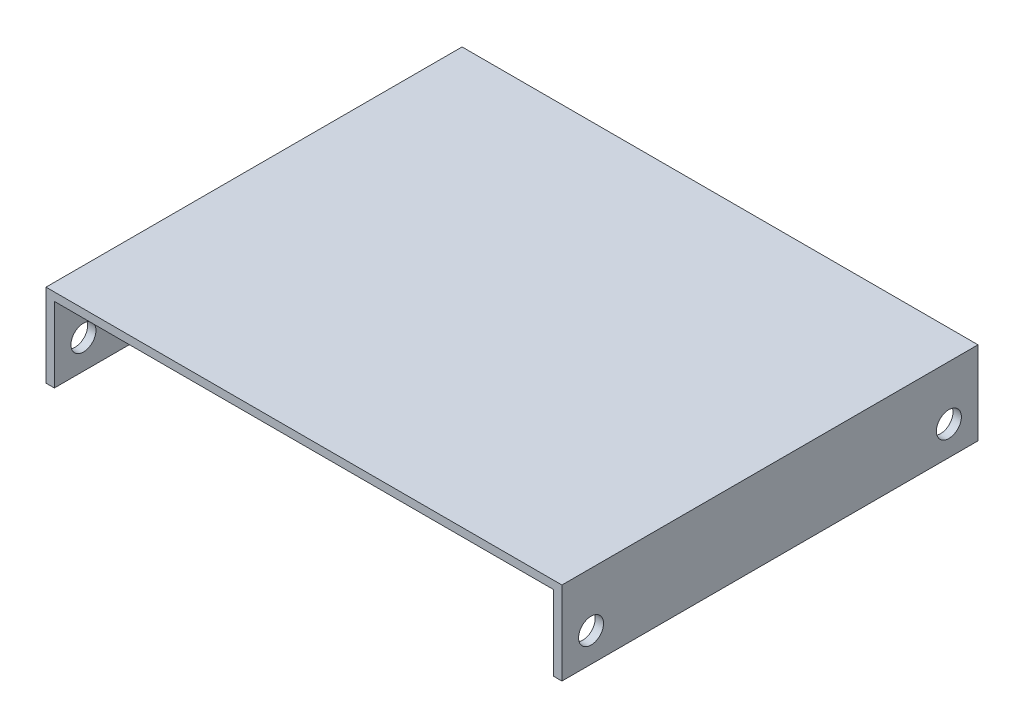
ISO-10303-21;
HEADER;
FILE_DESCRIPTION(('STEP AP214'),'2;1');
FILE_NAME('part.step','',(''),(''),'','','');
FILE_SCHEMA(('AUTOMOTIVE_DESIGN { 1 0 10303 214 1 1 1 1 }'));
ENDSEC;
DATA;
#1=APPLICATION_CONTEXT('core data for automotive mechanical design processes');
#2=APPLICATION_PROTOCOL_DEFINITION('international standard','automotive_design',2000,#1);
#3=PRODUCT_CONTEXT('',#1,'mechanical');
#4=PRODUCT('Part','Part','',(#3));
#5=PRODUCT_RELATED_PRODUCT_CATEGORY('part','',(#4));
#6=PRODUCT_DEFINITION_FORMATION('','',#4);
#7=PRODUCT_DEFINITION_CONTEXT('part definition',#1,'design');
#8=PRODUCT_DEFINITION('design','',#6,#7);
#9=PRODUCT_DEFINITION_SHAPE('','',#8);
#10=(LENGTH_UNIT() NAMED_UNIT(*) SI_UNIT(.MILLI.,.METRE.));
#11=(NAMED_UNIT(*) PLANE_ANGLE_UNIT() SI_UNIT($,.RADIAN.));
#12=(NAMED_UNIT(*) SI_UNIT($,.STERADIAN.) SOLID_ANGLE_UNIT());
#13=UNCERTAINTY_MEASURE_WITH_UNIT(LENGTH_MEASURE(1.E-05),#10,'distance_accuracy_value','');
#14=(GEOMETRIC_REPRESENTATION_CONTEXT(3) GLOBAL_UNCERTAINTY_ASSIGNED_CONTEXT((#13)) GLOBAL_UNIT_ASSIGNED_CONTEXT((#10,
#11,#12)) REPRESENTATION_CONTEXT('',''));
#15=CARTESIAN_POINT('',(0.,0.,0.));
#16=DIRECTION('',(0.,0.,1.));
#17=DIRECTION('',(1.,0.,0.));
#18=AXIS2_PLACEMENT_3D('',#15,#16,#17);
#19=CARTESIAN_POINT('',(0.,0.,100.));
#20=DIRECTION('',(0.,1.,0.));
#21=DIRECTION('',(0.,0.,1.));
#22=AXIS2_PLACEMENT_3D('',#19,#20,#21);
#23=PLANE('',#22);
#24=DIRECTION('',(1.,0.,0.));
#25=VECTOR('',#24,1.);
#26=CARTESIAN_POINT('',(0.,0.,0.));
#27=LINE('',#26,#25);
#28=CARTESIAN_POINT('',(0.,0.,0.));
#29=VERTEX_POINT('',#28);
#30=CARTESIAN_POINT('',(2.,0.,0.));
#31=VERTEX_POINT('',#30);
#32=EDGE_CURVE('E130',#29,#31,#27,.T.);
#33=ORIENTED_EDGE('',*,*,#32,.T.);
#34=DIRECTION('',(0.,0.,-1.));
#35=VECTOR('',#34,1.);
#36=CARTESIAN_POINT('',(2.,0.,100.));
#37=LINE('',#36,#35);
#38=CARTESIAN_POINT('',(2.,0.,100.));
#39=VERTEX_POINT('',#38);
#40=EDGE_CURVE('E11',#39,#31,#37,.T.);
#41=ORIENTED_EDGE('',*,*,#40,.F.);
#42=DIRECTION('',(1.,0.,0.));
#43=VECTOR('',#42,1.);
#44=CARTESIAN_POINT('',(0.,0.,100.));
#45=LINE('',#44,#43);
#46=CARTESIAN_POINT('',(0.,0.,100.));
#47=VERTEX_POINT('',#46);
#48=EDGE_CURVE('E145',#47,#39,#45,.T.);
#49=ORIENTED_EDGE('',*,*,#48,.F.);
#50=DIRECTION('',(0.,0.,-1.));
#51=VECTOR('',#50,1.);
#52=CARTESIAN_POINT('',(0.,0.,100.));
#53=LINE('',#52,#51);
#54=EDGE_CURVE('E126',#47,#29,#53,.T.);
#55=ORIENTED_EDGE('',*,*,#54,.T.);
#56=EDGE_LOOP('',(#33,#41,#49,#55));
#57=FACE_BOUND('',#56,.T.);
#58=ADVANCED_FACE('F32',(#57),#23,.F.);
#59=CARTESIAN_POINT('',(2.,0.,100.));
#60=DIRECTION('',(-1.,0.,0.));
#61=DIRECTION('',(0.,0.,1.));
#62=AXIS2_PLACEMENT_3D('',#59,#60,#61);
#63=PLANE('',#62);
#64=CARTESIAN_POINT('',(2.,7.,7.));
#65=DIRECTION('',(-1.,0.,0.));
#66=DIRECTION('',(0.,0.,1.));
#67=AXIS2_PLACEMENT_3D('',#64,#65,#66);
#68=CIRCLE('',#67,3.);
#69=CARTESIAN_POINT('',(2.,7.,10.));
#70=VERTEX_POINT('',#69);
#71=EDGE_CURVE('E165',#70,#70,#68,.T.);
#72=ORIENTED_EDGE('',*,*,#71,.T.);
#73=EDGE_LOOP('',(#72));
#74=FACE_BOUND('',#73,.T.);
#75=CARTESIAN_POINT('',(2.,7.,93.));
#76=DIRECTION('',(-1.,0.,0.));
#77=DIRECTION('',(0.,0.,1.));
#78=AXIS2_PLACEMENT_3D('',#75,#76,#77);
#79=CIRCLE('',#78,3.00000000000001);
#80=CARTESIAN_POINT('',(2.,7.,96.));
#81=VERTEX_POINT('',#80);
#82=EDGE_CURVE('E134',#81,#81,#79,.T.);
#83=ORIENTED_EDGE('',*,*,#82,.T.);
#84=EDGE_LOOP('',(#83));
#85=FACE_BOUND('',#84,.T.);
#86=DIRECTION('',(0.,1.,0.));
#87=VECTOR('',#86,1.);
#88=CARTESIAN_POINT('',(2.,0.,0.));
#89=LINE('',#88,#87);
#90=CARTESIAN_POINT('',(2.,18.0419415076294,0.));
#91=VERTEX_POINT('',#90);
#92=EDGE_CURVE('E133',#31,#91,#89,.T.);
#93=ORIENTED_EDGE('',*,*,#92,.T.);
#94=DIRECTION('',(0.,0.,-1.));
#95=VECTOR('',#94,1.);
#96=CARTESIAN_POINT('',(2.,18.0419415076294,100.));
#97=LINE('',#96,#95);
#98=CARTESIAN_POINT('',(2.,18.0419415076294,100.));
#99=VERTEX_POINT('',#98);
#100=EDGE_CURVE('E41',#99,#91,#97,.T.);
#101=ORIENTED_EDGE('',*,*,#100,.F.);
#102=DIRECTION('',(0.,1.,0.));
#103=VECTOR('',#102,1.);
#104=CARTESIAN_POINT('',(2.,0.,100.));
#105=LINE('',#104,#103);
#106=EDGE_CURVE('E93',#39,#99,#105,.T.);
#107=ORIENTED_EDGE('',*,*,#106,.F.);
#108=ORIENTED_EDGE('',*,*,#40,.T.);
#109=EDGE_LOOP('',(#93,#101,#107,#108));
#110=FACE_BOUND('',#109,.T.);
#111=ADVANCED_FACE('F211',(#74,#85,#110),#63,.F.);
#112=CARTESIAN_POINT('',(2.,18.0419415076294,100.));
#113=DIRECTION('',(0.,1.,0.));
#114=DIRECTION('',(0.,0.,1.));
#115=AXIS2_PLACEMENT_3D('',#112,#113,#114);
#116=PLANE('',#115);
#117=DIRECTION('',(1.,0.,0.));
#118=VECTOR('',#117,1.);
#119=CARTESIAN_POINT('',(2.,18.0419415076294,0.));
#120=LINE('',#119,#118);
#121=CARTESIAN_POINT('',(122.,18.0419415076294,0.));
#122=VERTEX_POINT('',#121);
#123=EDGE_CURVE('E136',#91,#122,#120,.T.);
#124=ORIENTED_EDGE('',*,*,#123,.T.);
#125=DIRECTION('',(0.,0.,-1.));
#126=VECTOR('',#125,1.);
#127=CARTESIAN_POINT('',(122.,18.0419415076294,100.));
#128=LINE('',#127,#126);
#129=CARTESIAN_POINT('',(122.,18.0419415076294,100.));
#130=VERTEX_POINT('',#129);
#131=EDGE_CURVE('E152',#130,#122,#128,.T.);
#132=ORIENTED_EDGE('',*,*,#131,.F.);
#133=DIRECTION('',(1.,0.,0.));
#134=VECTOR('',#133,1.);
#135=CARTESIAN_POINT('',(2.,18.0419415076294,100.));
#136=LINE('',#135,#134);
#137=EDGE_CURVE('E178',#99,#130,#136,.T.);
#138=ORIENTED_EDGE('',*,*,#137,.F.);
#139=ORIENTED_EDGE('',*,*,#100,.T.);
#140=EDGE_LOOP('',(#124,#132,#138,#139));
#141=FACE_BOUND('',#140,.T.);
#142=ADVANCED_FACE('F215',(#141),#116,.F.);
#143=CARTESIAN_POINT('',(122.,0.,100.));
#144=DIRECTION('',(1.,0.,0.));
#145=DIRECTION('',(0.,0.,-1.));
#146=AXIS2_PLACEMENT_3D('',#143,#144,#145);
#147=PLANE('',#146);
#148=CARTESIAN_POINT('',(122.,7.,7.));
#149=DIRECTION('',(1.,0.,0.));
#150=DIRECTION('',(0.,0.,-1.));
#151=AXIS2_PLACEMENT_3D('',#148,#149,#150);
#152=CIRCLE('',#151,3.);
#153=CARTESIAN_POINT('',(122.,7.,4.));
#154=VERTEX_POINT('',#153);
#155=EDGE_CURVE('E170',#154,#154,#152,.T.);
#156=ORIENTED_EDGE('',*,*,#155,.T.);
#157=EDGE_LOOP('',(#156));
#158=FACE_BOUND('',#157,.T.);
#159=CARTESIAN_POINT('',(122.,7.,93.));
#160=DIRECTION('',(1.,0.,0.));
#161=DIRECTION('',(0.,0.,-1.));
#162=AXIS2_PLACEMENT_3D('',#159,#160,#161);
#163=CIRCLE('',#162,3.00000000000001);
#164=CARTESIAN_POINT('',(122.,7.,90.));
#165=VERTEX_POINT('',#164);
#166=EDGE_CURVE('E158',#165,#165,#163,.T.);
#167=ORIENTED_EDGE('',*,*,#166,.T.);
#168=EDGE_LOOP('',(#167));
#169=FACE_BOUND('',#168,.T.);
#170=DIRECTION('',(0.,-1.,0.));
#171=VECTOR('',#170,1.);
#172=CARTESIAN_POINT('',(122.,0.,0.));
#173=LINE('',#172,#171);
#174=CARTESIAN_POINT('',(122.,0.,0.));
#175=VERTEX_POINT('',#174);
#176=EDGE_CURVE('E138',#122,#175,#173,.T.);
#177=ORIENTED_EDGE('',*,*,#176,.T.);
#178=DIRECTION('',(0.,0.,-1.));
#179=VECTOR('',#178,1.);
#180=CARTESIAN_POINT('',(122.,0.,100.));
#181=LINE('',#180,#179);
#182=CARTESIAN_POINT('',(122.,0.,100.));
#183=VERTEX_POINT('',#182);
#184=EDGE_CURVE('E149',#183,#175,#181,.T.);
#185=ORIENTED_EDGE('',*,*,#184,.F.);
#186=DIRECTION('',(0.,-1.,0.));
#187=VECTOR('',#186,1.);
#188=CARTESIAN_POINT('',(122.,0.,100.));
#189=LINE('',#188,#187);
#190=EDGE_CURVE('E180',#130,#183,#189,.T.);
#191=ORIENTED_EDGE('',*,*,#190,.F.);
#192=ORIENTED_EDGE('',*,*,#131,.T.);
#193=EDGE_LOOP('',(#177,#185,#191,#192));
#194=FACE_BOUND('',#193,.T.);
#195=ADVANCED_FACE('F186',(#158,#169,#194),#147,.F.);
#196=CARTESIAN_POINT('',(124.,0.,100.));
#197=DIRECTION('',(0.,1.,0.));
#198=DIRECTION('',(-1.,0.,0.));
#199=AXIS2_PLACEMENT_3D('',#196,#197,#198);
#200=PLANE('',#199);
#201=DIRECTION('',(1.,0.,0.));
#202=VECTOR('',#201,1.);
#203=CARTESIAN_POINT('',(124.,0.,0.));
#204=LINE('',#203,#202);
#205=CARTESIAN_POINT('',(124.,0.,0.));
#206=VERTEX_POINT('',#205);
#207=EDGE_CURVE('E140',#175,#206,#204,.T.);
#208=ORIENTED_EDGE('',*,*,#207,.T.);
#209=DIRECTION('',(0.,0.,-1.));
#210=VECTOR('',#209,1.);
#211=CARTESIAN_POINT('',(124.,0.,100.));
#212=LINE('',#211,#210);
#213=CARTESIAN_POINT('',(124.,0.,100.));
#214=VERTEX_POINT('',#213);
#215=EDGE_CURVE('E121',#214,#206,#212,.T.);
#216=ORIENTED_EDGE('',*,*,#215,.F.);
#217=DIRECTION('',(1.,0.,0.));
#218=VECTOR('',#217,1.);
#219=CARTESIAN_POINT('',(124.,0.,100.));
#220=LINE('',#219,#218);
#221=EDGE_CURVE('E112',#183,#214,#220,.T.);
#222=ORIENTED_EDGE('',*,*,#221,.F.);
#223=ORIENTED_EDGE('',*,*,#184,.T.);
#224=EDGE_LOOP('',(#208,#216,#222,#223));
#225=FACE_BOUND('',#224,.T.);
#226=ADVANCED_FACE('F190',(#225),#200,.F.);
#227=CARTESIAN_POINT('',(124.,20.,100.));
#228=DIRECTION('',(-1.,0.,0.));
#229=DIRECTION('',(0.,0.,1.));
#230=AXIS2_PLACEMENT_3D('',#227,#228,#229);
#231=PLANE('',#230);
#232=CARTESIAN_POINT('',(124.,7.,7.));
#233=DIRECTION('',(1.,0.,0.));
#234=DIRECTION('',(0.,0.,-1.));
#235=AXIS2_PLACEMENT_3D('',#232,#233,#234);
#236=CIRCLE('',#235,3.);
#237=CARTESIAN_POINT('',(124.,7.,4.));
#238=VERTEX_POINT('',#237);
#239=EDGE_CURVE('E236',#238,#238,#236,.T.);
#240=ORIENTED_EDGE('',*,*,#239,.F.);
#241=EDGE_LOOP('',(#240));
#242=FACE_BOUND('',#241,.T.);
#243=CARTESIAN_POINT('',(124.,7.,93.));
#244=DIRECTION('',(1.,0.,0.));
#245=DIRECTION('',(0.,0.,-1.));
#246=AXIS2_PLACEMENT_3D('',#243,#244,#245);
#247=CIRCLE('',#246,3.00000000000001);
#248=CARTESIAN_POINT('',(124.,7.,90.));
#249=VERTEX_POINT('',#248);
#250=EDGE_CURVE('E159',#249,#249,#247,.T.);
#251=ORIENTED_EDGE('',*,*,#250,.F.);
#252=EDGE_LOOP('',(#251));
#253=FACE_BOUND('',#252,.T.);
#254=DIRECTION('',(0.,1.,0.));
#255=VECTOR('',#254,1.);
#256=CARTESIAN_POINT('',(124.,20.,0.));
#257=LINE('',#256,#255);
#258=CARTESIAN_POINT('',(124.,20.,0.));
#259=VERTEX_POINT('',#258);
#260=EDGE_CURVE('E120',#206,#259,#257,.T.);
#261=ORIENTED_EDGE('',*,*,#260,.T.);
#262=DIRECTION('',(0.,0.,-1.));
#263=VECTOR('',#262,1.);
#264=CARTESIAN_POINT('',(124.,20.,100.));
#265=LINE('',#264,#263);
#266=CARTESIAN_POINT('',(124.,20.,100.));
#267=VERTEX_POINT('',#266);
#268=EDGE_CURVE('E117',#267,#259,#265,.T.);
#269=ORIENTED_EDGE('',*,*,#268,.F.);
#270=DIRECTION('',(0.,1.,0.));
#271=VECTOR('',#270,1.);
#272=CARTESIAN_POINT('',(124.,20.,100.));
#273=LINE('',#272,#271);
#274=EDGE_CURVE('E106',#214,#267,#273,.T.);
#275=ORIENTED_EDGE('',*,*,#274,.F.);
#276=ORIENTED_EDGE('',*,*,#215,.T.);
#277=EDGE_LOOP('',(#261,#269,#275,#276));
#278=FACE_BOUND('',#277,.T.);
#279=ADVANCED_FACE('F118',(#242,#253,#278),#231,.F.);
#280=CARTESIAN_POINT('',(0.,20.,100.));
#281=DIRECTION('',(0.,-1.,0.));
#282=DIRECTION('',(0.,0.,-1.));
#283=AXIS2_PLACEMENT_3D('',#280,#281,#282);
#284=PLANE('',#283);
#285=DIRECTION('',(-1.,0.,0.));
#286=VECTOR('',#285,1.);
#287=CARTESIAN_POINT('',(0.,20.,0.));
#288=LINE('',#287,#286);
#289=CARTESIAN_POINT('',(0.,20.,0.));
#290=VERTEX_POINT('',#289);
#291=EDGE_CURVE('E79',#259,#290,#288,.T.);
#292=ORIENTED_EDGE('',*,*,#291,.T.);
#293=DIRECTION('',(0.,0.,-1.));
#294=VECTOR('',#293,1.);
#295=CARTESIAN_POINT('',(0.,20.,100.));
#296=LINE('',#295,#294);
#297=CARTESIAN_POINT('',(0.,20.,100.));
#298=VERTEX_POINT('',#297);
#299=EDGE_CURVE('E122',#298,#290,#296,.T.);
#300=ORIENTED_EDGE('',*,*,#299,.F.);
#301=DIRECTION('',(-1.,0.,0.));
#302=VECTOR('',#301,1.);
#303=CARTESIAN_POINT('',(0.,20.,100.));
#304=LINE('',#303,#302);
#305=EDGE_CURVE('E110',#267,#298,#304,.T.);
#306=ORIENTED_EDGE('',*,*,#305,.F.);
#307=ORIENTED_EDGE('',*,*,#268,.T.);
#308=EDGE_LOOP('',(#292,#300,#306,#307));
#309=FACE_BOUND('',#308,.T.);
#310=ADVANCED_FACE('F124',(#309),#284,.F.);
#311=CARTESIAN_POINT('',(0.,0.,100.));
#312=DIRECTION('',(1.,0.,0.));
#313=DIRECTION('',(0.,0.,-1.));
#314=AXIS2_PLACEMENT_3D('',#311,#312,#313);
#315=PLANE('',#314);
#316=CARTESIAN_POINT('',(0.,7.,7.));
#317=DIRECTION('',(1.,0.,0.));
#318=DIRECTION('',(0.,0.,-1.));
#319=AXIS2_PLACEMENT_3D('',#316,#317,#318);
#320=CIRCLE('',#319,3.);
#321=CARTESIAN_POINT('',(0.,7.,4.));
#322=VERTEX_POINT('',#321);
#323=EDGE_CURVE('E35',#322,#322,#320,.T.);
#324=ORIENTED_EDGE('',*,*,#323,.T.);
#325=EDGE_LOOP('',(#324));
#326=FACE_BOUND('',#325,.T.);
#327=CARTESIAN_POINT('',(0.,7.,93.));
#328=DIRECTION('',(1.,0.,0.));
#329=DIRECTION('',(0.,0.,-1.));
#330=AXIS2_PLACEMENT_3D('',#327,#328,#329);
#331=CIRCLE('',#330,3.00000000000001);
#332=CARTESIAN_POINT('',(0.,7.,90.));
#333=VERTEX_POINT('',#332);
#334=EDGE_CURVE('E156',#333,#333,#331,.T.);
#335=ORIENTED_EDGE('',*,*,#334,.T.);
#336=EDGE_LOOP('',(#335));
#337=FACE_BOUND('',#336,.T.);
#338=DIRECTION('',(0.,-1.,0.));
#339=VECTOR('',#338,1.);
#340=CARTESIAN_POINT('',(0.,0.,0.));
#341=LINE('',#340,#339);
#342=EDGE_CURVE('E85',#290,#29,#341,.T.);
#343=ORIENTED_EDGE('',*,*,#342,.T.);
#344=ORIENTED_EDGE('',*,*,#54,.F.);
#345=DIRECTION('',(0.,-1.,0.));
#346=VECTOR('',#345,1.);
#347=CARTESIAN_POINT('',(0.,0.,100.));
#348=LINE('',#347,#346);
#349=EDGE_CURVE('E50',#298,#47,#348,.T.);
#350=ORIENTED_EDGE('',*,*,#349,.F.);
#351=ORIENTED_EDGE('',*,*,#299,.T.);
#352=EDGE_LOOP('',(#343,#344,#350,#351));
#353=FACE_BOUND('',#352,.T.);
#354=ADVANCED_FACE('F198',(#326,#337,#353),#315,.F.);
#355=CARTESIAN_POINT('',(0.,0.,100.));
#356=DIRECTION('',(0.,0.,1.));
#357=DIRECTION('',(1.,0.,0.));
#358=AXIS2_PLACEMENT_3D('',#355,#356,#357);
#359=PLANE('',#358);
#360=ORIENTED_EDGE('',*,*,#48,.T.);
#361=ORIENTED_EDGE('',*,*,#106,.T.);
#362=ORIENTED_EDGE('',*,*,#137,.T.);
#363=ORIENTED_EDGE('',*,*,#190,.T.);
#364=ORIENTED_EDGE('',*,*,#221,.T.);
#365=ORIENTED_EDGE('',*,*,#274,.T.);
#366=ORIENTED_EDGE('',*,*,#305,.T.);
#367=ORIENTED_EDGE('',*,*,#349,.T.);
#368=EDGE_LOOP('',(#360,#361,#362,#363,#364,#365,#366,#367));
#369=FACE_BOUND('',#368,.T.);
#370=ADVANCED_FACE('F108',(#369),#359,.T.);
#371=CARTESIAN_POINT('',(0.,0.,0.));
#372=DIRECTION('',(0.,0.,1.));
#373=DIRECTION('',(1.,0.,0.));
#374=AXIS2_PLACEMENT_3D('',#371,#372,#373);
#375=PLANE('',#374);
#376=ORIENTED_EDGE('',*,*,#32,.F.);
#377=ORIENTED_EDGE('',*,*,#342,.F.);
#378=ORIENTED_EDGE('',*,*,#291,.F.);
#379=ORIENTED_EDGE('',*,*,#260,.F.);
#380=ORIENTED_EDGE('',*,*,#207,.F.);
#381=ORIENTED_EDGE('',*,*,#176,.F.);
#382=ORIENTED_EDGE('',*,*,#123,.F.);
#383=ORIENTED_EDGE('',*,*,#92,.F.);
#384=EDGE_LOOP('',(#376,#377,#378,#379,#380,#381,#382,#383));
#385=FACE_BOUND('',#384,.T.);
#386=ADVANCED_FACE('F193',(#385),#375,.F.);
#387=CARTESIAN_POINT('',(-17.,7.,93.));
#388=DIRECTION('',(1.,0.,0.));
#389=DIRECTION('',(0.,0.,-1.));
#390=AXIS2_PLACEMENT_3D('',#387,#388,#389);
#391=CYLINDRICAL_SURFACE('',#390,3.00000000000001);
#392=ORIENTED_EDGE('',*,*,#334,.F.);
#393=EDGE_LOOP('',(#392));
#394=FACE_BOUND('',#393,.T.);
#395=ORIENTED_EDGE('',*,*,#82,.F.);
#396=EDGE_LOOP('',(#395));
#397=FACE_BOUND('',#396,.T.);
#398=ADVANCED_FACE('F253',(#394,#397),#391,.F.);
#399=ORIENTED_EDGE('',*,*,#250,.T.);
#400=EDGE_LOOP('',(#399));
#401=FACE_BOUND('',#400,.T.);
#402=ORIENTED_EDGE('',*,*,#166,.F.);
#403=EDGE_LOOP('',(#402));
#404=FACE_BOUND('',#403,.T.);
#405=ADVANCED_FACE('F250',(#401,#404),#391,.F.);
#406=CARTESIAN_POINT('',(-17.,7.,7.));
#407=DIRECTION('',(1.,0.,0.));
#408=DIRECTION('',(0.,0.,-1.));
#409=AXIS2_PLACEMENT_3D('',#406,#407,#408);
#410=CYLINDRICAL_SURFACE('',#409,3.);
#411=ORIENTED_EDGE('',*,*,#323,.F.);
#412=EDGE_LOOP('',(#411));
#413=FACE_BOUND('',#412,.T.);
#414=ORIENTED_EDGE('',*,*,#71,.F.);
#415=EDGE_LOOP('',(#414));
#416=FACE_BOUND('',#415,.T.);
#417=ADVANCED_FACE('F245',(#413,#416),#410,.F.);
#418=ORIENTED_EDGE('',*,*,#239,.T.);
#419=EDGE_LOOP('',(#418));
#420=FACE_BOUND('',#419,.T.);
#421=ORIENTED_EDGE('',*,*,#155,.F.);
#422=EDGE_LOOP('',(#421));
#423=FACE_BOUND('',#422,.T.);
#424=ADVANCED_FACE('F243',(#420,#423),#410,.F.);
#425=CLOSED_SHELL('',(#58,#111,#142,#195,#226,#279,#310,#354,#370,#386,#398,#405,#417,#424));
#426=MANIFOLD_SOLID_BREP('B2',#425);
#427=ADVANCED_BREP_SHAPE_REPRESENTATION('',(#18,#426),#14);
#428=SHAPE_DEFINITION_REPRESENTATION(#9,#427);
ENDSEC;
END-ISO-10303-21;
